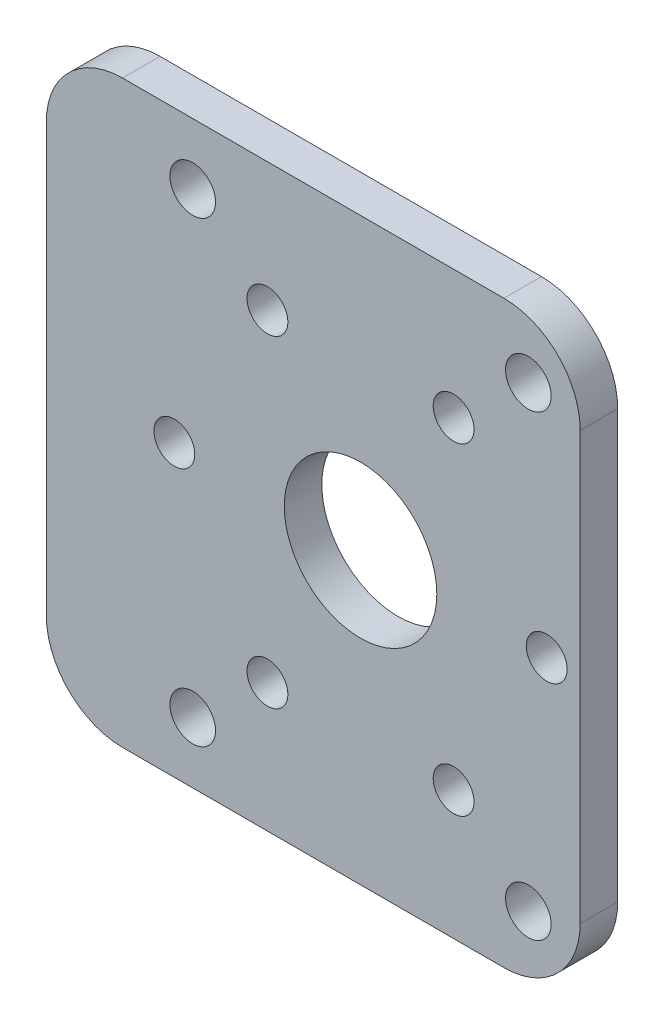
ISO-10303-21;
HEADER;
FILE_DESCRIPTION(('STEP AP214'),'2;1');
FILE_NAME('part.step','',(''),(''),'','','');
FILE_SCHEMA(('AUTOMOTIVE_DESIGN { 1 0 10303 214 1 1 1 1 }'));
ENDSEC;
DATA;
#1=APPLICATION_CONTEXT('core data for automotive mechanical design processes');
#2=APPLICATION_PROTOCOL_DEFINITION('international standard','automotive_design',2000,#1);
#3=PRODUCT_CONTEXT('',#1,'mechanical');
#4=PRODUCT('Part','Part','',(#3));
#5=PRODUCT_RELATED_PRODUCT_CATEGORY('part','',(#4));
#6=PRODUCT_DEFINITION_FORMATION('','',#4);
#7=PRODUCT_DEFINITION_CONTEXT('part definition',#1,'design');
#8=PRODUCT_DEFINITION('design','',#6,#7);
#9=PRODUCT_DEFINITION_SHAPE('','',#8);
#10=(LENGTH_UNIT() NAMED_UNIT(*) SI_UNIT(.MILLI.,.METRE.));
#11=(NAMED_UNIT(*) PLANE_ANGLE_UNIT() SI_UNIT($,.RADIAN.));
#12=(NAMED_UNIT(*) SI_UNIT($,.STERADIAN.) SOLID_ANGLE_UNIT());
#13=UNCERTAINTY_MEASURE_WITH_UNIT(LENGTH_MEASURE(1.E-05),#10,'distance_accuracy_value','');
#14=(GEOMETRIC_REPRESENTATION_CONTEXT(3) GLOBAL_UNCERTAINTY_ASSIGNED_CONTEXT((#13)) GLOBAL_UNIT_ASSIGNED_CONTEXT((#10,
#11,#12)) REPRESENTATION_CONTEXT('',''));
#15=CARTESIAN_POINT('',(0.,0.,0.));
#16=DIRECTION('',(0.,0.,1.));
#17=DIRECTION('',(1.,0.,0.));
#18=AXIS2_PLACEMENT_3D('',#15,#16,#17);
#19=CARTESIAN_POINT('',(69.85,48.26,3.1242));
#20=DIRECTION('',(1.,0.,0.));
#21=DIRECTION('',(0.,0.,-1.));
#22=AXIS2_PLACEMENT_3D('',#19,#20,#21);
#23=PLANE('',#22);
#24=DIRECTION('',(0.,-1.,0.));
#25=VECTOR('',#24,1.);
#26=CARTESIAN_POINT('',(69.85,48.26,0.));
#27=LINE('',#26,#25);
#28=CARTESIAN_POINT('',(69.85,41.91,0.));
#29=VERTEX_POINT('',#28);
#30=CARTESIAN_POINT('',(69.85,6.35000000000002,0.));
#31=VERTEX_POINT('',#30);
#32=EDGE_CURVE('E200',#29,#31,#27,.T.);
#33=ORIENTED_EDGE('',*,*,#32,.T.);
#34=DIRECTION('',(0.,0.,-1.));
#35=VECTOR('',#34,1.);
#36=CARTESIAN_POINT('',(69.85,6.35,3.1242));
#37=LINE('',#36,#35);
#38=CARTESIAN_POINT('',(69.85,6.35000000000002,3.1242));
#39=VERTEX_POINT('',#38);
#40=EDGE_CURVE('E11',#31,#39,#37,.F.);
#41=ORIENTED_EDGE('',*,*,#40,.T.);
#42=DIRECTION('',(0.,-1.,0.));
#43=VECTOR('',#42,1.);
#44=CARTESIAN_POINT('',(69.85,48.26,3.1242));
#45=LINE('',#44,#43);
#46=CARTESIAN_POINT('',(69.85,41.91,3.1242));
#47=VERTEX_POINT('',#46);
#48=EDGE_CURVE('E151',#47,#39,#45,.T.);
#49=ORIENTED_EDGE('',*,*,#48,.F.);
#50=DIRECTION('',(0.,0.,-1.));
#51=VECTOR('',#50,1.);
#52=CARTESIAN_POINT('',(69.85,41.91,3.1242));
#53=LINE('',#52,#51);
#54=EDGE_CURVE('E48',#47,#29,#53,.T.);
#55=ORIENTED_EDGE('',*,*,#54,.T.);
#56=EDGE_LOOP('',(#33,#41,#49,#55));
#57=FACE_BOUND('',#56,.T.);
#58=ADVANCED_FACE('F39',(#57),#23,.F.);
#59=CARTESIAN_POINT('',(69.85,0.,3.1242));
#60=DIRECTION('',(0.,1.,0.));
#61=DIRECTION('',(-1.,0.,0.));
#62=AXIS2_PLACEMENT_3D('',#59,#60,#61);
#63=PLANE('',#62);
#64=DIRECTION('',(1.,0.,0.));
#65=VECTOR('',#64,1.);
#66=CARTESIAN_POINT('',(69.85,0.,0.));
#67=LINE('',#66,#65);
#68=CARTESIAN_POINT('',(76.2,0.,0.));
#69=VERTEX_POINT('',#68);
#70=CARTESIAN_POINT('',(107.95,0.,0.));
#71=VERTEX_POINT('',#70);
#72=EDGE_CURVE('E160',#69,#71,#67,.T.);
#73=ORIENTED_EDGE('',*,*,#72,.T.);
#74=DIRECTION('',(0.,0.,-1.));
#75=VECTOR('',#74,1.);
#76=CARTESIAN_POINT('',(107.95,0.,3.1242));
#77=LINE('',#76,#75);
#78=CARTESIAN_POINT('',(107.95,0.,3.1242));
#79=VERTEX_POINT('',#78);
#80=EDGE_CURVE('E58',#71,#79,#77,.F.);
#81=ORIENTED_EDGE('',*,*,#80,.T.);
#82=DIRECTION('',(1.,0.,0.));
#83=VECTOR('',#82,1.);
#84=CARTESIAN_POINT('',(69.85,0.,3.1242));
#85=LINE('',#84,#83);
#86=CARTESIAN_POINT('',(76.2,0.,3.1242));
#87=VERTEX_POINT('',#86);
#88=EDGE_CURVE('E157',#87,#79,#85,.T.);
#89=ORIENTED_EDGE('',*,*,#88,.F.);
#90=DIRECTION('',(0.,0.,-1.));
#91=VECTOR('',#90,1.);
#92=CARTESIAN_POINT('',(76.2,0.,3.1242));
#93=LINE('',#92,#91);
#94=EDGE_CURVE('E189',#87,#69,#93,.T.);
#95=ORIENTED_EDGE('',*,*,#94,.T.);
#96=EDGE_LOOP('',(#73,#81,#89,#95));
#97=FACE_BOUND('',#96,.T.);
#98=ADVANCED_FACE('F336',(#97),#63,.F.);
#99=CARTESIAN_POINT('',(114.3,48.26,3.1242));
#100=DIRECTION('',(-1.,0.,0.));
#101=DIRECTION('',(0.,-1.,0.));
#102=AXIS2_PLACEMENT_3D('',#99,#100,#101);
#103=PLANE('',#102);
#104=DIRECTION('',(0.,1.,0.));
#105=VECTOR('',#104,1.);
#106=CARTESIAN_POINT('',(114.3,48.26,0.));
#107=LINE('',#106,#105);
#108=CARTESIAN_POINT('',(114.3,6.35000000000002,0.));
#109=VERTEX_POINT('',#108);
#110=CARTESIAN_POINT('',(114.3,41.91,0.));
#111=VERTEX_POINT('',#110);
#112=EDGE_CURVE('E152',#109,#111,#107,.T.);
#113=ORIENTED_EDGE('',*,*,#112,.T.);
#114=DIRECTION('',(0.,0.,-1.));
#115=VECTOR('',#114,1.);
#116=CARTESIAN_POINT('',(114.3,41.91,3.1242));
#117=LINE('',#116,#115);
#118=CARTESIAN_POINT('',(114.3,41.91,3.1242));
#119=VERTEX_POINT('',#118);
#120=EDGE_CURVE('E127',#111,#119,#117,.F.);
#121=ORIENTED_EDGE('',*,*,#120,.T.);
#122=DIRECTION('',(0.,1.,0.));
#123=VECTOR('',#122,1.);
#124=CARTESIAN_POINT('',(114.3,48.26,3.1242));
#125=LINE('',#124,#123);
#126=CARTESIAN_POINT('',(114.3,6.35000000000002,3.1242));
#127=VERTEX_POINT('',#126);
#128=EDGE_CURVE('E216',#127,#119,#125,.T.);
#129=ORIENTED_EDGE('',*,*,#128,.F.);
#130=DIRECTION('',(0.,0.,-1.));
#131=VECTOR('',#130,1.);
#132=CARTESIAN_POINT('',(114.3,6.35,3.1242));
#133=LINE('',#132,#131);
#134=EDGE_CURVE('E133',#127,#109,#133,.T.);
#135=ORIENTED_EDGE('',*,*,#134,.T.);
#136=EDGE_LOOP('',(#113,#121,#129,#135));
#137=FACE_BOUND('',#136,.T.);
#138=ADVANCED_FACE('F333',(#137),#103,.F.);
#139=CARTESIAN_POINT('',(69.85,48.26,3.1242));
#140=DIRECTION('',(0.,-1.,0.));
#141=DIRECTION('',(0.,0.,-1.));
#142=AXIS2_PLACEMENT_3D('',#139,#140,#141);
#143=PLANE('',#142);
#144=DIRECTION('',(-1.,0.,0.));
#145=VECTOR('',#144,1.);
#146=CARTESIAN_POINT('',(69.85,48.26,3.1242));
#147=LINE('',#146,#145);
#148=CARTESIAN_POINT('',(107.95,48.26,3.1242));
#149=VERTEX_POINT('',#148);
#150=CARTESIAN_POINT('',(76.2,48.26,3.1242));
#151=VERTEX_POINT('',#150);
#152=EDGE_CURVE('E143',#149,#151,#147,.T.);
#153=ORIENTED_EDGE('',*,*,#152,.F.);
#154=DIRECTION('',(0.,0.,-1.));
#155=VECTOR('',#154,1.);
#156=CARTESIAN_POINT('',(107.95,48.26,3.1242));
#157=LINE('',#156,#155);
#158=CARTESIAN_POINT('',(107.95,48.26,0.));
#159=VERTEX_POINT('',#158);
#160=EDGE_CURVE('E126',#149,#159,#157,.T.);
#161=ORIENTED_EDGE('',*,*,#160,.T.);
#162=DIRECTION('',(-1.,0.,0.));
#163=VECTOR('',#162,1.);
#164=CARTESIAN_POINT('',(69.85,48.26,0.));
#165=LINE('',#164,#163);
#166=CARTESIAN_POINT('',(76.2,48.26,0.));
#167=VERTEX_POINT('',#166);
#168=EDGE_CURVE('E140',#159,#167,#165,.T.);
#169=ORIENTED_EDGE('',*,*,#168,.T.);
#170=DIRECTION('',(0.,0.,-1.));
#171=VECTOR('',#170,1.);
#172=CARTESIAN_POINT('',(76.2,48.26,3.1242));
#173=LINE('',#172,#171);
#174=EDGE_CURVE('E146',#167,#151,#173,.F.);
#175=ORIENTED_EDGE('',*,*,#174,.T.);
#176=EDGE_LOOP('',(#153,#161,#169,#175));
#177=FACE_BOUND('',#176,.T.);
#178=ADVANCED_FACE('F139',(#177),#143,.F.);
#179=CARTESIAN_POINT('',(0.,0.,3.1242));
#180=DIRECTION('',(0.,0.,1.));
#181=DIRECTION('',(1.,0.,0.));
#182=AXIS2_PLACEMENT_3D('',#179,#180,#181);
#183=PLANE('',#182);
#184=CARTESIAN_POINT('',(111.512,24.13,3.1242));
#185=DIRECTION('',(0.,0.,1.));
#186=DIRECTION('',(1.,0.,0.));
#187=AXIS2_PLACEMENT_3D('',#184,#185,#186);
#188=CIRCLE('',#187,1.69999999999999);
#189=CARTESIAN_POINT('',(113.212,24.13,3.1242));
#190=VERTEX_POINT('',#189);
#191=EDGE_CURVE('E299',#190,#190,#188,.T.);
#192=ORIENTED_EDGE('',*,*,#191,.F.);
#193=EDGE_LOOP('',(#192));
#194=FACE_BOUND('',#193,.T.);
#195=CARTESIAN_POINT('',(103.762,10.7066062413412,3.1242));
#196=DIRECTION('',(0.,0.,1.));
#197=DIRECTION('',(1.,0.,0.));
#198=AXIS2_PLACEMENT_3D('',#195,#196,#197);
#199=CIRCLE('',#198,1.69999999999999);
#200=CARTESIAN_POINT('',(105.462,10.7066062413412,3.1242));
#201=VERTEX_POINT('',#200);
#202=EDGE_CURVE('E291',#201,#201,#199,.T.);
#203=ORIENTED_EDGE('',*,*,#202,.F.);
#204=EDGE_LOOP('',(#203));
#205=FACE_BOUND('',#204,.T.);
#206=CARTESIAN_POINT('',(88.262,10.7066062413412,3.1242));
#207=DIRECTION('',(0.,0.,1.));
#208=DIRECTION('',(1.,0.,0.));
#209=AXIS2_PLACEMENT_3D('',#206,#207,#208);
#210=CIRCLE('',#209,1.69999999999999);
#211=CARTESIAN_POINT('',(89.9619999999999,10.7066062413412,3.1242));
#212=VERTEX_POINT('',#211);
#213=EDGE_CURVE('E283',#212,#212,#210,.T.);
#214=ORIENTED_EDGE('',*,*,#213,.F.);
#215=EDGE_LOOP('',(#214));
#216=FACE_BOUND('',#215,.T.);
#217=CARTESIAN_POINT('',(80.512,24.1300000000001,3.1242));
#218=DIRECTION('',(0.,0.,1.));
#219=DIRECTION('',(1.,0.,0.));
#220=AXIS2_PLACEMENT_3D('',#217,#218,#219);
#221=CIRCLE('',#220,1.69999999999999);
#222=CARTESIAN_POINT('',(82.212,24.1300000000001,3.1242));
#223=VERTEX_POINT('',#222);
#224=EDGE_CURVE('E276',#223,#223,#221,.T.);
#225=ORIENTED_EDGE('',*,*,#224,.F.);
#226=EDGE_LOOP('',(#225));
#227=FACE_BOUND('',#226,.T.);
#228=CARTESIAN_POINT('',(88.2620000000001,37.5533937586589,3.1242));
#229=DIRECTION('',(0.,0.,1.));
#230=DIRECTION('',(1.,0.,0.));
#231=AXIS2_PLACEMENT_3D('',#228,#229,#230);
#232=CIRCLE('',#231,1.69999999999999);
#233=CARTESIAN_POINT('',(89.9620000000001,37.5533937586589,3.1242));
#234=VERTEX_POINT('',#233);
#235=EDGE_CURVE('E268',#234,#234,#232,.T.);
#236=ORIENTED_EDGE('',*,*,#235,.F.);
#237=EDGE_LOOP('',(#236));
#238=FACE_BOUND('',#237,.T.);
#239=CARTESIAN_POINT('',(103.762,37.5533937586587,3.1242));
#240=DIRECTION('',(0.,0.,1.));
#241=DIRECTION('',(1.,0.,0.));
#242=AXIS2_PLACEMENT_3D('',#239,#240,#241);
#243=CIRCLE('',#242,1.69999999999999);
#244=CARTESIAN_POINT('',(105.462,37.5533937586587,3.1242));
#245=VERTEX_POINT('',#244);
#246=EDGE_CURVE('E260',#245,#245,#243,.T.);
#247=ORIENTED_EDGE('',*,*,#246,.F.);
#248=EDGE_LOOP('',(#247));
#249=FACE_BOUND('',#248,.T.);
#250=CARTESIAN_POINT('',(96.012,24.13,3.1242));
#251=DIRECTION('',(0.,0.,1.));
#252=DIRECTION('',(1.,0.,0.));
#253=AXIS2_PLACEMENT_3D('',#250,#251,#252);
#254=CIRCLE('',#253,6.35);
#255=CARTESIAN_POINT('',(102.362,24.13,3.1242));
#256=VERTEX_POINT('',#255);
#257=EDGE_CURVE('E249',#256,#256,#254,.T.);
#258=ORIENTED_EDGE('',*,*,#257,.F.);
#259=EDGE_LOOP('',(#258));
#260=FACE_BOUND('',#259,.T.);
#261=CARTESIAN_POINT('',(82.042,43.18,3.1242));
#262=DIRECTION('',(0.,0.,1.));
#263=DIRECTION('',(1.,0.,0.));
#264=AXIS2_PLACEMENT_3D('',#261,#262,#263);
#265=CIRCLE('',#264,1.89865);
#266=CARTESIAN_POINT('',(83.94065,43.18,3.1242));
#267=VERTEX_POINT('',#266);
#268=EDGE_CURVE('E244',#267,#267,#265,.T.);
#269=ORIENTED_EDGE('',*,*,#268,.F.);
#270=EDGE_LOOP('',(#269));
#271=FACE_BOUND('',#270,.T.);
#272=CARTESIAN_POINT('',(109.982,43.18,3.1242));
#273=DIRECTION('',(0.,0.,1.));
#274=DIRECTION('',(1.,0.,0.));
#275=AXIS2_PLACEMENT_3D('',#272,#273,#274);
#276=CIRCLE('',#275,1.89865);
#277=CARTESIAN_POINT('',(111.88065,43.18,3.1242));
#278=VERTEX_POINT('',#277);
#279=EDGE_CURVE('E237',#278,#278,#276,.T.);
#280=ORIENTED_EDGE('',*,*,#279,.F.);
#281=EDGE_LOOP('',(#280));
#282=FACE_BOUND('',#281,.T.);
#283=CARTESIAN_POINT('',(109.982,5.08000000000001,3.1242));
#284=DIRECTION('',(0.,0.,1.));
#285=DIRECTION('',(1.,0.,0.));
#286=AXIS2_PLACEMENT_3D('',#283,#284,#285);
#287=CIRCLE('',#286,1.89865);
#288=CARTESIAN_POINT('',(111.88065,5.08000000000001,3.1242));
#289=VERTEX_POINT('',#288);
#290=EDGE_CURVE('E229',#289,#289,#287,.T.);
#291=ORIENTED_EDGE('',*,*,#290,.F.);
#292=EDGE_LOOP('',(#291));
#293=FACE_BOUND('',#292,.T.);
#294=CARTESIAN_POINT('',(82.042,5.08,3.1242));
#295=DIRECTION('',(0.,0.,1.));
#296=DIRECTION('',(1.,0.,0.));
#297=AXIS2_PLACEMENT_3D('',#294,#295,#296);
#298=CIRCLE('',#297,1.89865);
#299=CARTESIAN_POINT('',(83.94065,5.08,3.1242));
#300=VERTEX_POINT('',#299);
#301=EDGE_CURVE('E212',#300,#300,#298,.T.);
#302=ORIENTED_EDGE('',*,*,#301,.F.);
#303=EDGE_LOOP('',(#302));
#304=FACE_BOUND('',#303,.T.);
#305=ORIENTED_EDGE('',*,*,#128,.T.);
#306=CARTESIAN_POINT('',(107.95,41.91,3.1242));
#307=DIRECTION('',(0.,0.,1.));
#308=DIRECTION('',(1.,0.,0.));
#309=AXIS2_PLACEMENT_3D('',#306,#307,#308);
#310=CIRCLE('',#309,6.35);
#311=EDGE_CURVE('E186',#119,#149,#310,.T.);
#312=ORIENTED_EDGE('',*,*,#311,.T.);
#313=ORIENTED_EDGE('',*,*,#152,.T.);
#314=CARTESIAN_POINT('',(76.2,41.91,3.1242));
#315=DIRECTION('',(0.,0.,1.));
#316=DIRECTION('',(1.,0.,0.));
#317=AXIS2_PLACEMENT_3D('',#314,#315,#316);
#318=CIRCLE('',#317,6.35);
#319=EDGE_CURVE('E178',#151,#47,#318,.T.);
#320=ORIENTED_EDGE('',*,*,#319,.T.);
#321=ORIENTED_EDGE('',*,*,#48,.T.);
#322=CARTESIAN_POINT('',(76.2,6.35,3.1242));
#323=DIRECTION('',(0.,0.,1.));
#324=DIRECTION('',(1.,0.,0.));
#325=AXIS2_PLACEMENT_3D('',#322,#323,#324);
#326=CIRCLE('',#325,6.35);
#327=EDGE_CURVE('E68',#39,#87,#326,.T.);
#328=ORIENTED_EDGE('',*,*,#327,.T.);
#329=ORIENTED_EDGE('',*,*,#88,.T.);
#330=CARTESIAN_POINT('',(107.95,6.35,3.1242));
#331=DIRECTION('',(0.,0.,1.));
#332=DIRECTION('',(1.,0.,0.));
#333=AXIS2_PLACEMENT_3D('',#330,#331,#332);
#334=CIRCLE('',#333,6.35);
#335=EDGE_CURVE('E183',#79,#127,#334,.T.);
#336=ORIENTED_EDGE('',*,*,#335,.T.);
#337=EDGE_LOOP('',(#305,#312,#313,#320,#321,#328,#329,#336));
#338=FACE_BOUND('',#337,.T.);
#339=ADVANCED_FACE('F306',(#194,#205,#216,#227,#238,#249,#260,#271,#282,#293,#304,#338),#183,.T.);
#340=CARTESIAN_POINT('',(0.,0.,0.));
#341=DIRECTION('',(0.,0.,1.));
#342=DIRECTION('',(1.,0.,0.));
#343=AXIS2_PLACEMENT_3D('',#340,#341,#342);
#344=PLANE('',#343);
#345=CARTESIAN_POINT('',(111.512,24.13,0.));
#346=DIRECTION('',(0.,0.,1.));
#347=DIRECTION('',(1.,0.,0.));
#348=AXIS2_PLACEMENT_3D('',#345,#346,#347);
#349=CIRCLE('',#348,1.69999999999999);
#350=CARTESIAN_POINT('',(113.212,24.13,0.));
#351=VERTEX_POINT('',#350);
#352=EDGE_CURVE('E295',#351,#351,#349,.T.);
#353=ORIENTED_EDGE('',*,*,#352,.T.);
#354=EDGE_LOOP('',(#353));
#355=FACE_BOUND('',#354,.T.);
#356=CARTESIAN_POINT('',(103.762,10.7066062413412,0.));
#357=DIRECTION('',(0.,0.,1.));
#358=DIRECTION('',(1.,0.,0.));
#359=AXIS2_PLACEMENT_3D('',#356,#357,#358);
#360=CIRCLE('',#359,1.69999999999999);
#361=CARTESIAN_POINT('',(105.462,10.7066062413412,0.));
#362=VERTEX_POINT('',#361);
#363=EDGE_CURVE('E287',#362,#362,#360,.T.);
#364=ORIENTED_EDGE('',*,*,#363,.T.);
#365=EDGE_LOOP('',(#364));
#366=FACE_BOUND('',#365,.T.);
#367=CARTESIAN_POINT('',(88.262,10.7066062413412,0.));
#368=DIRECTION('',(0.,0.,1.));
#369=DIRECTION('',(1.,0.,0.));
#370=AXIS2_PLACEMENT_3D('',#367,#368,#369);
#371=CIRCLE('',#370,1.69999999999999);
#372=CARTESIAN_POINT('',(89.9619999999999,10.7066062413412,0.));
#373=VERTEX_POINT('',#372);
#374=EDGE_CURVE('E279',#373,#373,#371,.T.);
#375=ORIENTED_EDGE('',*,*,#374,.T.);
#376=EDGE_LOOP('',(#375));
#377=FACE_BOUND('',#376,.T.);
#378=CARTESIAN_POINT('',(80.512,24.1300000000001,0.));
#379=DIRECTION('',(0.,0.,1.));
#380=DIRECTION('',(1.,0.,0.));
#381=AXIS2_PLACEMENT_3D('',#378,#379,#380);
#382=CIRCLE('',#381,1.69999999999999);
#383=CARTESIAN_POINT('',(82.212,24.1300000000001,0.));
#384=VERTEX_POINT('',#383);
#385=EDGE_CURVE('E272',#384,#384,#382,.T.);
#386=ORIENTED_EDGE('',*,*,#385,.T.);
#387=EDGE_LOOP('',(#386));
#388=FACE_BOUND('',#387,.T.);
#389=CARTESIAN_POINT('',(88.2620000000001,37.5533937586589,0.));
#390=DIRECTION('',(0.,0.,1.));
#391=DIRECTION('',(1.,0.,0.));
#392=AXIS2_PLACEMENT_3D('',#389,#390,#391);
#393=CIRCLE('',#392,1.69999999999999);
#394=CARTESIAN_POINT('',(89.9620000000001,37.5533937586589,0.));
#395=VERTEX_POINT('',#394);
#396=EDGE_CURVE('E264',#395,#395,#393,.T.);
#397=ORIENTED_EDGE('',*,*,#396,.T.);
#398=EDGE_LOOP('',(#397));
#399=FACE_BOUND('',#398,.T.);
#400=CARTESIAN_POINT('',(103.762,37.5533937586587,0.));
#401=DIRECTION('',(0.,0.,1.));
#402=DIRECTION('',(1.,0.,0.));
#403=AXIS2_PLACEMENT_3D('',#400,#401,#402);
#404=CIRCLE('',#403,1.69999999999999);
#405=CARTESIAN_POINT('',(105.462,37.5533937586587,0.));
#406=VERTEX_POINT('',#405);
#407=EDGE_CURVE('E253',#406,#406,#404,.T.);
#408=ORIENTED_EDGE('',*,*,#407,.T.);
#409=EDGE_LOOP('',(#408));
#410=FACE_BOUND('',#409,.T.);
#411=CARTESIAN_POINT('',(96.012,24.13,0.));
#412=DIRECTION('',(0.,0.,1.));
#413=DIRECTION('',(1.,0.,0.));
#414=AXIS2_PLACEMENT_3D('',#411,#412,#413);
#415=CIRCLE('',#414,6.35);
#416=CARTESIAN_POINT('',(102.362,24.13,0.));
#417=VERTEX_POINT('',#416);
#418=EDGE_CURVE('E248',#417,#417,#415,.T.);
#419=ORIENTED_EDGE('',*,*,#418,.T.);
#420=EDGE_LOOP('',(#419));
#421=FACE_BOUND('',#420,.T.);
#422=CARTESIAN_POINT('',(82.042,43.18,0.));
#423=DIRECTION('',(0.,0.,1.));
#424=DIRECTION('',(1.,0.,0.));
#425=AXIS2_PLACEMENT_3D('',#422,#423,#424);
#426=CIRCLE('',#425,1.89865);
#427=CARTESIAN_POINT('',(83.94065,43.18,0.));
#428=VERTEX_POINT('',#427);
#429=EDGE_CURVE('E240',#428,#428,#426,.T.);
#430=ORIENTED_EDGE('',*,*,#429,.T.);
#431=EDGE_LOOP('',(#430));
#432=FACE_BOUND('',#431,.T.);
#433=CARTESIAN_POINT('',(109.982,43.18,0.));
#434=DIRECTION('',(0.,0.,1.));
#435=DIRECTION('',(1.,0.,0.));
#436=AXIS2_PLACEMENT_3D('',#433,#434,#435);
#437=CIRCLE('',#436,1.89865);
#438=CARTESIAN_POINT('',(111.88065,43.18,0.));
#439=VERTEX_POINT('',#438);
#440=EDGE_CURVE('E233',#439,#439,#437,.T.);
#441=ORIENTED_EDGE('',*,*,#440,.T.);
#442=EDGE_LOOP('',(#441));
#443=FACE_BOUND('',#442,.T.);
#444=CARTESIAN_POINT('',(109.982,5.08000000000001,0.));
#445=DIRECTION('',(0.,0.,1.));
#446=DIRECTION('',(1.,0.,0.));
#447=AXIS2_PLACEMENT_3D('',#444,#445,#446);
#448=CIRCLE('',#447,1.89865);
#449=CARTESIAN_POINT('',(111.88065,5.08000000000001,0.));
#450=VERTEX_POINT('',#449);
#451=EDGE_CURVE('E225',#450,#450,#448,.T.);
#452=ORIENTED_EDGE('',*,*,#451,.T.);
#453=EDGE_LOOP('',(#452));
#454=FACE_BOUND('',#453,.T.);
#455=CARTESIAN_POINT('',(82.042,5.08,0.));
#456=DIRECTION('',(0.,0.,1.));
#457=DIRECTION('',(1.,0.,0.));
#458=AXIS2_PLACEMENT_3D('',#455,#456,#457);
#459=CIRCLE('',#458,1.89865);
#460=CARTESIAN_POINT('',(83.94065,5.08,0.));
#461=VERTEX_POINT('',#460);
#462=EDGE_CURVE('E206',#461,#461,#459,.T.);
#463=ORIENTED_EDGE('',*,*,#462,.T.);
#464=EDGE_LOOP('',(#463));
#465=FACE_BOUND('',#464,.T.);
#466=ORIENTED_EDGE('',*,*,#168,.F.);
#467=CARTESIAN_POINT('',(107.95,41.91,0.));
#468=DIRECTION('',(0.,0.,1.));
#469=DIRECTION('',(1.,0.,0.));
#470=AXIS2_PLACEMENT_3D('',#467,#468,#469);
#471=CIRCLE('',#470,6.35);
#472=EDGE_CURVE('E122',#159,#111,#471,.F.);
#473=ORIENTED_EDGE('',*,*,#472,.T.);
#474=ORIENTED_EDGE('',*,*,#112,.F.);
#475=CARTESIAN_POINT('',(107.95,6.35,0.));
#476=DIRECTION('',(0.,0.,1.));
#477=DIRECTION('',(1.,0.,0.));
#478=AXIS2_PLACEMENT_3D('',#475,#476,#477);
#479=CIRCLE('',#478,6.35);
#480=EDGE_CURVE('E134',#109,#71,#479,.F.);
#481=ORIENTED_EDGE('',*,*,#480,.T.);
#482=ORIENTED_EDGE('',*,*,#72,.F.);
#483=CARTESIAN_POINT('',(76.2,6.35,0.));
#484=DIRECTION('',(0.,0.,1.));
#485=DIRECTION('',(1.,0.,0.));
#486=AXIS2_PLACEMENT_3D('',#483,#484,#485);
#487=CIRCLE('',#486,6.35);
#488=EDGE_CURVE('E168',#69,#31,#487,.F.);
#489=ORIENTED_EDGE('',*,*,#488,.T.);
#490=ORIENTED_EDGE('',*,*,#32,.F.);
#491=CARTESIAN_POINT('',(76.2,41.91,0.));
#492=DIRECTION('',(0.,0.,1.));
#493=DIRECTION('',(1.,0.,0.));
#494=AXIS2_PLACEMENT_3D('',#491,#492,#493);
#495=CIRCLE('',#494,6.35);
#496=EDGE_CURVE('E145',#29,#167,#495,.F.);
#497=ORIENTED_EDGE('',*,*,#496,.T.);
#498=EDGE_LOOP('',(#466,#473,#474,#481,#482,#489,#490,#497));
#499=FACE_BOUND('',#498,.T.);
#500=ADVANCED_FACE('F148',(#355,#366,#377,#388,#399,#410,#421,#432,#443,#454,#465,#499),#344,.F.);
#501=CARTESIAN_POINT('',(107.95,41.91,3.1242));
#502=DIRECTION('',(0.,0.,-1.));
#503=DIRECTION('',(-1.,0.,0.));
#504=AXIS2_PLACEMENT_3D('',#501,#502,#503);
#505=CYLINDRICAL_SURFACE('',#504,6.35);
#506=ORIENTED_EDGE('',*,*,#311,.F.);
#507=ORIENTED_EDGE('',*,*,#120,.F.);
#508=ORIENTED_EDGE('',*,*,#472,.F.);
#509=ORIENTED_EDGE('',*,*,#160,.F.);
#510=EDGE_LOOP('',(#506,#507,#508,#509));
#511=FACE_BOUND('',#510,.T.);
#512=ADVANCED_FACE('F125',(#511),#505,.T.);
#513=CARTESIAN_POINT('',(107.95,6.35,3.1242));
#514=DIRECTION('',(0.,0.,-1.));
#515=DIRECTION('',(-1.,0.,0.));
#516=AXIS2_PLACEMENT_3D('',#513,#514,#515);
#517=CYLINDRICAL_SURFACE('',#516,6.35);
#518=ORIENTED_EDGE('',*,*,#335,.F.);
#519=ORIENTED_EDGE('',*,*,#80,.F.);
#520=ORIENTED_EDGE('',*,*,#480,.F.);
#521=ORIENTED_EDGE('',*,*,#134,.F.);
#522=EDGE_LOOP('',(#518,#519,#520,#521));
#523=FACE_BOUND('',#522,.T.);
#524=ADVANCED_FACE('F335',(#523),#517,.T.);
#525=CARTESIAN_POINT('',(76.2,6.35,3.1242));
#526=DIRECTION('',(0.,0.,-1.));
#527=DIRECTION('',(-1.,0.,0.));
#528=AXIS2_PLACEMENT_3D('',#525,#526,#527);
#529=CYLINDRICAL_SURFACE('',#528,6.35);
#530=ORIENTED_EDGE('',*,*,#327,.F.);
#531=ORIENTED_EDGE('',*,*,#40,.F.);
#532=ORIENTED_EDGE('',*,*,#488,.F.);
#533=ORIENTED_EDGE('',*,*,#94,.F.);
#534=EDGE_LOOP('',(#530,#531,#532,#533));
#535=FACE_BOUND('',#534,.T.);
#536=ADVANCED_FACE('F339',(#535),#529,.T.);
#537=CARTESIAN_POINT('',(76.2,41.91,3.1242));
#538=DIRECTION('',(0.,0.,-1.));
#539=DIRECTION('',(-1.,0.,0.));
#540=AXIS2_PLACEMENT_3D('',#537,#538,#539);
#541=CYLINDRICAL_SURFACE('',#540,6.35);
#542=ORIENTED_EDGE('',*,*,#319,.F.);
#543=ORIENTED_EDGE('',*,*,#174,.F.);
#544=ORIENTED_EDGE('',*,*,#496,.F.);
#545=ORIENTED_EDGE('',*,*,#54,.F.);
#546=EDGE_LOOP('',(#542,#543,#544,#545));
#547=FACE_BOUND('',#546,.T.);
#548=ADVANCED_FACE('F41',(#547),#541,.T.);
#549=CARTESIAN_POINT('',(82.042,5.08,3.1242));
#550=DIRECTION('',(0.,0.,1.));
#551=DIRECTION('',(1.,0.,0.));
#552=AXIS2_PLACEMENT_3D('',#549,#550,#551);
#553=CYLINDRICAL_SURFACE('',#552,1.89865);
#554=ORIENTED_EDGE('',*,*,#301,.T.);
#555=EDGE_LOOP('',(#554));
#556=FACE_BOUND('',#555,.T.);
#557=ORIENTED_EDGE('',*,*,#462,.F.);
#558=EDGE_LOOP('',(#557));
#559=FACE_BOUND('',#558,.T.);
#560=ADVANCED_FACE('F341',(#556,#559),#553,.F.);
#561=CARTESIAN_POINT('',(109.982,5.08000000000001,3.1242));
#562=DIRECTION('',(0.,0.,1.));
#563=DIRECTION('',(1.,0.,0.));
#564=AXIS2_PLACEMENT_3D('',#561,#562,#563);
#565=CYLINDRICAL_SURFACE('',#564,1.89865);
#566=ORIENTED_EDGE('',*,*,#290,.T.);
#567=EDGE_LOOP('',(#566));
#568=FACE_BOUND('',#567,.T.);
#569=ORIENTED_EDGE('',*,*,#451,.F.);
#570=EDGE_LOOP('',(#569));
#571=FACE_BOUND('',#570,.T.);
#572=ADVANCED_FACE('F346',(#568,#571),#565,.F.);
#573=CARTESIAN_POINT('',(109.982,43.18,3.1242));
#574=DIRECTION('',(0.,0.,1.));
#575=DIRECTION('',(1.,0.,0.));
#576=AXIS2_PLACEMENT_3D('',#573,#574,#575);
#577=CYLINDRICAL_SURFACE('',#576,1.89865);
#578=ORIENTED_EDGE('',*,*,#279,.T.);
#579=EDGE_LOOP('',(#578));
#580=FACE_BOUND('',#579,.T.);
#581=ORIENTED_EDGE('',*,*,#440,.F.);
#582=EDGE_LOOP('',(#581));
#583=FACE_BOUND('',#582,.T.);
#584=ADVANCED_FACE('F391',(#580,#583),#577,.F.);
#585=CARTESIAN_POINT('',(82.042,43.18,3.1242));
#586=DIRECTION('',(0.,0.,1.));
#587=DIRECTION('',(1.,0.,0.));
#588=AXIS2_PLACEMENT_3D('',#585,#586,#587);
#589=CYLINDRICAL_SURFACE('',#588,1.89865);
#590=ORIENTED_EDGE('',*,*,#268,.T.);
#591=EDGE_LOOP('',(#590));
#592=FACE_BOUND('',#591,.T.);
#593=ORIENTED_EDGE('',*,*,#429,.F.);
#594=EDGE_LOOP('',(#593));
#595=FACE_BOUND('',#594,.T.);
#596=ADVANCED_FACE('F402',(#592,#595),#589,.F.);
#597=CARTESIAN_POINT('',(96.012,24.13,0.));
#598=DIRECTION('',(0.,0.,1.));
#599=DIRECTION('',(1.,0.,0.));
#600=AXIS2_PLACEMENT_3D('',#597,#598,#599);
#601=CYLINDRICAL_SURFACE('',#600,6.35);
#602=ORIENTED_EDGE('',*,*,#418,.F.);
#603=EDGE_LOOP('',(#602));
#604=FACE_BOUND('',#603,.T.);
#605=ORIENTED_EDGE('',*,*,#257,.T.);
#606=EDGE_LOOP('',(#605));
#607=FACE_BOUND('',#606,.T.);
#608=ADVANCED_FACE('F413',(#604,#607),#601,.F.);
#609=CARTESIAN_POINT('',(103.762,37.5533937586587,3.1242));
#610=DIRECTION('',(0.,0.,1.));
#611=DIRECTION('',(1.,0.,0.));
#612=AXIS2_PLACEMENT_3D('',#609,#610,#611);
#613=CYLINDRICAL_SURFACE('',#612,1.69999999999999);
#614=ORIENTED_EDGE('',*,*,#407,.F.);
#615=EDGE_LOOP('',(#614));
#616=FACE_BOUND('',#615,.T.);
#617=ORIENTED_EDGE('',*,*,#246,.T.);
#618=EDGE_LOOP('',(#617));
#619=FACE_BOUND('',#618,.T.);
#620=ADVANCED_FACE('F423',(#616,#619),#613,.F.);
#621=CARTESIAN_POINT('',(88.2620000000001,37.5533937586589,3.1242));
#622=DIRECTION('',(0.,0.,1.));
#623=DIRECTION('',(1.,0.,0.));
#624=AXIS2_PLACEMENT_3D('',#621,#622,#623);
#625=CYLINDRICAL_SURFACE('',#624,1.69999999999999);
#626=ORIENTED_EDGE('',*,*,#396,.F.);
#627=EDGE_LOOP('',(#626));
#628=FACE_BOUND('',#627,.T.);
#629=ORIENTED_EDGE('',*,*,#235,.T.);
#630=EDGE_LOOP('',(#629));
#631=FACE_BOUND('',#630,.T.);
#632=ADVANCED_FACE('F449',(#628,#631),#625,.F.);
#633=CARTESIAN_POINT('',(80.512,24.1300000000001,3.1242));
#634=DIRECTION('',(0.,0.,1.));
#635=DIRECTION('',(1.,0.,0.));
#636=AXIS2_PLACEMENT_3D('',#633,#634,#635);
#637=CYLINDRICAL_SURFACE('',#636,1.69999999999999);
#638=ORIENTED_EDGE('',*,*,#385,.F.);
#639=EDGE_LOOP('',(#638));
#640=FACE_BOUND('',#639,.T.);
#641=ORIENTED_EDGE('',*,*,#224,.T.);
#642=EDGE_LOOP('',(#641));
#643=FACE_BOUND('',#642,.T.);
#644=ADVANCED_FACE('F459',(#640,#643),#637,.F.);
#645=CARTESIAN_POINT('',(88.262,10.7066062413412,3.1242));
#646=DIRECTION('',(0.,0.,1.));
#647=DIRECTION('',(1.,0.,0.));
#648=AXIS2_PLACEMENT_3D('',#645,#646,#647);
#649=CYLINDRICAL_SURFACE('',#648,1.69999999999999);
#650=ORIENTED_EDGE('',*,*,#374,.F.);
#651=EDGE_LOOP('',(#650));
#652=FACE_BOUND('',#651,.T.);
#653=ORIENTED_EDGE('',*,*,#213,.T.);
#654=EDGE_LOOP('',(#653));
#655=FACE_BOUND('',#654,.T.);
#656=ADVANCED_FACE('F468',(#652,#655),#649,.F.);
#657=CARTESIAN_POINT('',(103.762,10.7066062413412,3.1242));
#658=DIRECTION('',(0.,0.,1.));
#659=DIRECTION('',(1.,0.,0.));
#660=AXIS2_PLACEMENT_3D('',#657,#658,#659);
#661=CYLINDRICAL_SURFACE('',#660,1.69999999999999);
#662=ORIENTED_EDGE('',*,*,#363,.F.);
#663=EDGE_LOOP('',(#662));
#664=FACE_BOUND('',#663,.T.);
#665=ORIENTED_EDGE('',*,*,#202,.T.);
#666=EDGE_LOOP('',(#665));
#667=FACE_BOUND('',#666,.T.);
#668=ADVANCED_FACE('F478',(#664,#667),#661,.F.);
#669=CARTESIAN_POINT('',(111.512,24.13,3.1242));
#670=DIRECTION('',(0.,0.,1.));
#671=DIRECTION('',(1.,0.,0.));
#672=AXIS2_PLACEMENT_3D('',#669,#670,#671);
#673=CYLINDRICAL_SURFACE('',#672,1.69999999999999);
#674=ORIENTED_EDGE('',*,*,#352,.F.);
#675=EDGE_LOOP('',(#674));
#676=FACE_BOUND('',#675,.T.);
#677=ORIENTED_EDGE('',*,*,#191,.T.);
#678=EDGE_LOOP('',(#677));
#679=FACE_BOUND('',#678,.T.);
#680=ADVANCED_FACE('F304',(#676,#679),#673,.F.);
#681=CLOSED_SHELL('',(#58,#98,#138,#178,#339,#500,#512,#524,#536,#548,#560,#572,#584,#596,#608,
#620,#632,#644,#656,#668,#680));
#682=MANIFOLD_SOLID_BREP('B2',#681);
#683=ADVANCED_BREP_SHAPE_REPRESENTATION('',(#18,#682),#14);
#684=SHAPE_DEFINITION_REPRESENTATION(#9,#683);
ENDSEC;
END-ISO-10303-21;
